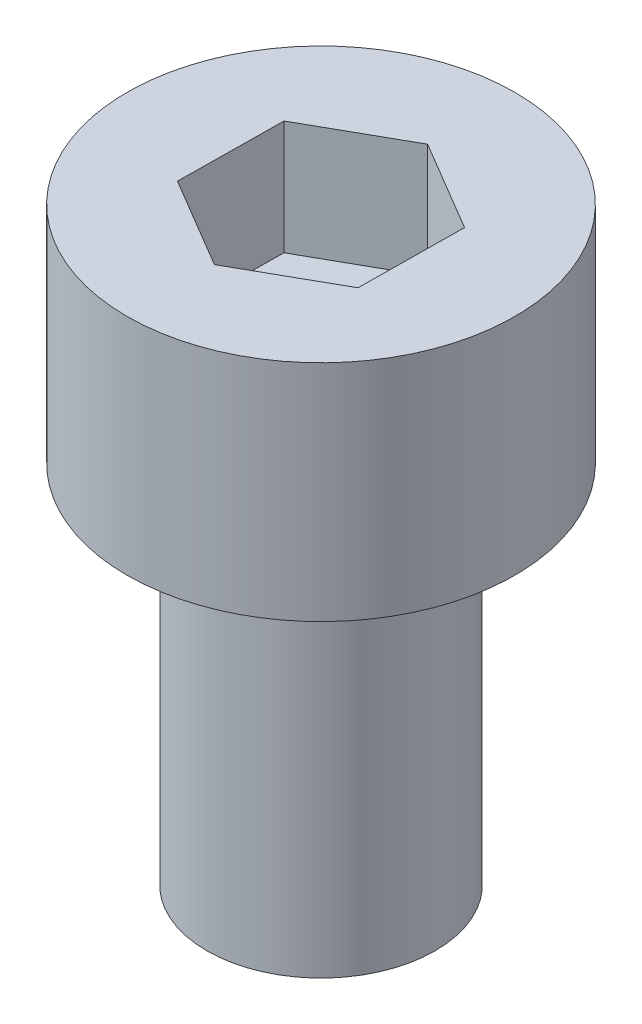
ISO-10303-21;
HEADER;
FILE_DESCRIPTION(('STEP AP214'),'2;1');
FILE_NAME('part.step','',(''),(''),'','','');
FILE_SCHEMA(('AUTOMOTIVE_DESIGN { 1 0 10303 214 1 1 1 1 }'));
ENDSEC;
DATA;
#1=APPLICATION_CONTEXT('core data for automotive mechanical design processes');
#2=APPLICATION_PROTOCOL_DEFINITION('international standard','automotive_design',2000,#1);
#3=PRODUCT_CONTEXT('',#1,'mechanical');
#4=PRODUCT('Part','Part','',(#3));
#5=PRODUCT_RELATED_PRODUCT_CATEGORY('part','',(#4));
#6=PRODUCT_DEFINITION_FORMATION('','',#4);
#7=PRODUCT_DEFINITION_CONTEXT('part definition',#1,'design');
#8=PRODUCT_DEFINITION('design','',#6,#7);
#9=PRODUCT_DEFINITION_SHAPE('','',#8);
#10=(LENGTH_UNIT() NAMED_UNIT(*) SI_UNIT(.MILLI.,.METRE.));
#11=(NAMED_UNIT(*) PLANE_ANGLE_UNIT() SI_UNIT($,.RADIAN.));
#12=(NAMED_UNIT(*) SI_UNIT($,.STERADIAN.) SOLID_ANGLE_UNIT());
#13=UNCERTAINTY_MEASURE_WITH_UNIT(LENGTH_MEASURE(1.E-05),#10,'distance_accuracy_value','');
#14=(GEOMETRIC_REPRESENTATION_CONTEXT(3) GLOBAL_UNCERTAINTY_ASSIGNED_CONTEXT((#13)) GLOBAL_UNIT_ASSIGNED_CONTEXT((#10,
#11,#12)) REPRESENTATION_CONTEXT('',''));
#15=CARTESIAN_POINT('',(0.,0.,0.));
#16=DIRECTION('',(0.,0.,1.));
#17=DIRECTION('',(1.,0.,0.));
#18=AXIS2_PLACEMENT_3D('',#15,#16,#17);
#19=CARTESIAN_POINT('',(0.,8.,0.));
#20=DIRECTION('',(0.,-1.,0.));
#21=DIRECTION('',(0.,0.,-1.));
#22=AXIS2_PLACEMENT_3D('',#19,#20,#21);
#23=CYLINDRICAL_SURFACE('',#22,2.5);
#24=CARTESIAN_POINT('',(0.,8.,0.));
#25=DIRECTION('',(0.,1.,0.));
#26=DIRECTION('',(0.,0.,1.));
#27=AXIS2_PLACEMENT_3D('',#24,#25,#26);
#28=CIRCLE('',#27,2.5);
#29=CARTESIAN_POINT('',(0.,8.,2.5));
#30=VERTEX_POINT('',#29);
#31=EDGE_CURVE('E11',#30,#30,#28,.T.);
#32=ORIENTED_EDGE('',*,*,#31,.F.);
#33=EDGE_LOOP('',(#32));
#34=FACE_BOUND('',#33,.T.);
#35=CARTESIAN_POINT('',(0.,0.,0.));
#36=DIRECTION('',(0.,1.,0.));
#37=DIRECTION('',(0.,0.,1.));
#38=AXIS2_PLACEMENT_3D('',#35,#36,#37);
#39=CIRCLE('',#38,2.5);
#40=CARTESIAN_POINT('',(0.,0.,2.5));
#41=VERTEX_POINT('',#40);
#42=EDGE_CURVE('E42',#41,#41,#39,.T.);
#43=ORIENTED_EDGE('',*,*,#42,.T.);
#44=EDGE_LOOP('',(#43));
#45=FACE_BOUND('',#44,.T.);
#46=ADVANCED_FACE('F39',(#34,#45),#23,.T.);
#47=CARTESIAN_POINT('',(0.,0.,0.));
#48=DIRECTION('',(0.,1.,0.));
#49=DIRECTION('',(0.,0.,1.));
#50=AXIS2_PLACEMENT_3D('',#47,#48,#49);
#51=PLANE('',#50);
#52=ORIENTED_EDGE('',*,*,#42,.F.);
#53=EDGE_LOOP('',(#52));
#54=FACE_BOUND('',#53,.T.);
#55=ADVANCED_FACE('F189',(#54),#51,.F.);
#56=CARTESIAN_POINT('',(0.,12.91,0.));
#57=DIRECTION('',(0.,-1.,0.));
#58=DIRECTION('',(0.,0.,-1.));
#59=AXIS2_PLACEMENT_3D('',#56,#57,#58);
#60=CYLINDRICAL_SURFACE('',#59,4.25);
#61=CARTESIAN_POINT('',(0.,12.91,0.));
#62=DIRECTION('',(0.,1.,0.));
#63=DIRECTION('',(0.,0.,1.));
#64=AXIS2_PLACEMENT_3D('',#61,#62,#63);
#65=CIRCLE('',#64,4.25);
#66=CARTESIAN_POINT('',(0.,12.91,4.25));
#67=VERTEX_POINT('',#66);
#68=EDGE_CURVE('E163',#67,#67,#65,.T.);
#69=ORIENTED_EDGE('',*,*,#68,.F.);
#70=EDGE_LOOP('',(#69));
#71=FACE_BOUND('',#70,.T.);
#72=CARTESIAN_POINT('',(0.,8.,0.));
#73=DIRECTION('',(0.,1.,0.));
#74=DIRECTION('',(0.,0.,1.));
#75=AXIS2_PLACEMENT_3D('',#72,#73,#74);
#76=CIRCLE('',#75,4.25);
#77=CARTESIAN_POINT('',(0.,8.,4.25));
#78=VERTEX_POINT('',#77);
#79=EDGE_CURVE('E153',#78,#78,#76,.T.);
#80=ORIENTED_EDGE('',*,*,#79,.T.);
#81=EDGE_LOOP('',(#80));
#82=FACE_BOUND('',#81,.T.);
#83=ADVANCED_FACE('F171',(#71,#82),#60,.T.);
#84=CARTESIAN_POINT('',(0.,12.91,0.));
#85=DIRECTION('',(0.,1.,0.));
#86=DIRECTION('',(0.,0.,1.));
#87=AXIS2_PLACEMENT_3D('',#84,#85,#86);
#88=PLANE('',#87);
#89=DIRECTION('',(0.871446941935933,0.,-0.490489783166286));
#90=VECTOR('',#89,1.);
#91=CARTESIAN_POINT('',(-0.0252806866898007,12.91,2.3092627005635));
#92=LINE('',#91,#90);
#93=CARTESIAN_POINT('',(-0.0252806866898007,12.91,2.3092627005635));
#94=VERTEX_POINT('',#93);
#95=CARTESIAN_POINT('',(1.98723981935495,12.91,1.17652506718023));
#96=VERTEX_POINT('',#95);
#97=EDGE_CURVE('E54',#94,#96,#92,.T.);
#98=ORIENTED_EDGE('',*,*,#97,.F.);
#99=DIRECTION('',(0.860500083486691,0.,0.509450298183638));
#100=VECTOR('',#99,1.);
#101=CARTESIAN_POINT('',(-2.01252050604475,12.91,1.13273763338327));
#102=LINE('',#101,#100);
#103=CARTESIAN_POINT('',(-2.01252050604475,12.91,1.13273763338327));
#104=VERTEX_POINT('',#103);
#105=EDGE_CURVE('E147',#104,#94,#102,.T.);
#106=ORIENTED_EDGE('',*,*,#105,.F.);
#107=DIRECTION('',(-0.0109468584492415,0.,0.999940081349924));
#108=VECTOR('',#107,1.);
#109=CARTESIAN_POINT('',(-1.98723981935495,12.91,-1.17652506718023));
#110=LINE('',#109,#108);
#111=CARTESIAN_POINT('',(-1.98723981935495,12.91,-1.17652506718023));
#112=VERTEX_POINT('',#111);
#113=EDGE_CURVE('E144',#112,#104,#110,.T.);
#114=ORIENTED_EDGE('',*,*,#113,.F.);
#115=DIRECTION('',(-0.871446941935933,0.,0.490489783166286));
#116=VECTOR('',#115,1.);
#117=CARTESIAN_POINT('',(0.0252806866898017,12.91,-2.3092627005635));
#118=LINE('',#117,#116);
#119=CARTESIAN_POINT('',(0.0252806866898017,12.91,-2.3092627005635));
#120=VERTEX_POINT('',#119);
#121=EDGE_CURVE('E102',#120,#112,#118,.T.);
#122=ORIENTED_EDGE('',*,*,#121,.F.);
#123=DIRECTION('',(-0.860500083486691,0.,-0.509450298183638));
#124=VECTOR('',#123,1.);
#125=CARTESIAN_POINT('',(2.01252050604475,12.91,-1.13273763338327));
#126=LINE('',#125,#124);
#127=CARTESIAN_POINT('',(2.01252050604475,12.91,-1.13273763338327));
#128=VERTEX_POINT('',#127);
#129=EDGE_CURVE('E138',#128,#120,#126,.T.);
#130=ORIENTED_EDGE('',*,*,#129,.F.);
#131=DIRECTION('',(0.0109468584492411,0.,-0.999940081349924));
#132=VECTOR('',#131,1.);
#133=CARTESIAN_POINT('',(1.98723981935495,12.91,1.17652506718023));
#134=LINE('',#133,#132);
#135=EDGE_CURVE('E134',#96,#128,#134,.T.);
#136=ORIENTED_EDGE('',*,*,#135,.F.);
#137=EDGE_LOOP('',(#98,#106,#114,#122,#130,#136));
#138=FACE_BOUND('',#137,.T.);
#139=ORIENTED_EDGE('',*,*,#68,.T.);
#140=EDGE_LOOP('',(#139));
#141=FACE_BOUND('',#140,.T.);
#142=ADVANCED_FACE('F176',(#138,#141),#88,.T.);
#143=CARTESIAN_POINT('',(0.,8.,0.));
#144=DIRECTION('',(0.,1.,0.));
#145=DIRECTION('',(0.,0.,1.));
#146=AXIS2_PLACEMENT_3D('',#143,#144,#145);
#147=PLANE('',#146);
#148=ORIENTED_EDGE('',*,*,#31,.T.);
#149=EDGE_LOOP('',(#148));
#150=FACE_BOUND('',#149,.T.);
#151=ORIENTED_EDGE('',*,*,#79,.F.);
#152=EDGE_LOOP('',(#151));
#153=FACE_BOUND('',#152,.T.);
#154=ADVANCED_FACE('F173',(#150,#153),#147,.F.);
#155=CARTESIAN_POINT('',(-0.0252806866898007,10.41,2.3092627005635));
#156=DIRECTION('',(0.490489783166286,0.,0.871446941935933));
#157=DIRECTION('',(0.871446941935933,0.,-0.490489783166286));
#158=AXIS2_PLACEMENT_3D('',#155,#156,#157);
#159=PLANE('',#158);
#160=ORIENTED_EDGE('',*,*,#97,.T.);
#161=DIRECTION('',(0.,1.,0.));
#162=VECTOR('',#161,1.);
#163=CARTESIAN_POINT('',(1.98723981935495,10.41,1.17652506718023));
#164=LINE('',#163,#162);
#165=CARTESIAN_POINT('',(1.98723981935495,10.41,1.17652506718023));
#166=VERTEX_POINT('',#165);
#167=EDGE_CURVE('E84',#166,#96,#164,.T.);
#168=ORIENTED_EDGE('',*,*,#167,.F.);
#169=DIRECTION('',(0.871446941935933,0.,-0.490489783166286));
#170=VECTOR('',#169,1.);
#171=CARTESIAN_POINT('',(-0.0252806866898007,10.41,2.3092627005635));
#172=LINE('',#171,#170);
#173=CARTESIAN_POINT('',(-0.0252806866898007,10.41,2.3092627005635));
#174=VERTEX_POINT('',#173);
#175=EDGE_CURVE('E150',#174,#166,#172,.T.);
#176=ORIENTED_EDGE('',*,*,#175,.F.);
#177=DIRECTION('',(0.,1.,0.));
#178=VECTOR('',#177,1.);
#179=CARTESIAN_POINT('',(-0.0252806866898007,10.41,2.3092627005635));
#180=LINE('',#179,#178);
#181=EDGE_CURVE('E62',#174,#94,#180,.T.);
#182=ORIENTED_EDGE('',*,*,#181,.T.);
#183=EDGE_LOOP('',(#160,#168,#176,#182));
#184=FACE_BOUND('',#183,.T.);
#185=ADVANCED_FACE('F175',(#184),#159,.F.);
#186=CARTESIAN_POINT('',(-2.01252050604475,10.41,1.13273763338327));
#187=DIRECTION('',(-0.509450298183638,0.,0.860500083486691));
#188=DIRECTION('',(0.860500083486691,0.,0.509450298183638));
#189=AXIS2_PLACEMENT_3D('',#186,#187,#188);
#190=PLANE('',#189);
#191=ORIENTED_EDGE('',*,*,#105,.T.);
#192=ORIENTED_EDGE('',*,*,#181,.F.);
#193=DIRECTION('',(0.860500083486691,0.,0.509450298183638));
#194=VECTOR('',#193,1.);
#195=CARTESIAN_POINT('',(-2.01252050604475,10.41,1.13273763338327));
#196=LINE('',#195,#194);
#197=CARTESIAN_POINT('',(-2.01252050604475,10.41,1.13273763338327));
#198=VERTEX_POINT('',#197);
#199=EDGE_CURVE('E116',#198,#174,#196,.T.);
#200=ORIENTED_EDGE('',*,*,#199,.F.);
#201=DIRECTION('',(0.,1.,0.));
#202=VECTOR('',#201,1.);
#203=CARTESIAN_POINT('',(-2.01252050604475,10.41,1.13273763338327));
#204=LINE('',#203,#202);
#205=EDGE_CURVE('E107',#198,#104,#204,.T.);
#206=ORIENTED_EDGE('',*,*,#205,.T.);
#207=EDGE_LOOP('',(#191,#192,#200,#206));
#208=FACE_BOUND('',#207,.T.);
#209=ADVANCED_FACE('F183',(#208),#190,.F.);
#210=CARTESIAN_POINT('',(-1.98723981935495,10.41,-1.17652506718023));
#211=DIRECTION('',(-0.999940081349924,0.,-0.0109468584492415));
#212=DIRECTION('',(-0.0109468584492415,0.,0.999940081349924));
#213=AXIS2_PLACEMENT_3D('',#210,#211,#212);
#214=PLANE('',#213);
#215=ORIENTED_EDGE('',*,*,#113,.T.);
#216=ORIENTED_EDGE('',*,*,#205,.F.);
#217=DIRECTION('',(-0.0109468584492415,0.,0.999940081349924));
#218=VECTOR('',#217,1.);
#219=CARTESIAN_POINT('',(-1.98723981935495,10.41,-1.17652506718023));
#220=LINE('',#219,#218);
#221=CARTESIAN_POINT('',(-1.98723981935495,10.41,-1.17652506718023));
#222=VERTEX_POINT('',#221);
#223=EDGE_CURVE('E111',#222,#198,#220,.T.);
#224=ORIENTED_EDGE('',*,*,#223,.F.);
#225=DIRECTION('',(0.,1.,0.));
#226=VECTOR('',#225,1.);
#227=CARTESIAN_POINT('',(-1.98723981935495,10.41,-1.17652506718023));
#228=LINE('',#227,#226);
#229=EDGE_CURVE('E95',#222,#112,#228,.T.);
#230=ORIENTED_EDGE('',*,*,#229,.T.);
#231=EDGE_LOOP('',(#215,#216,#224,#230));
#232=FACE_BOUND('',#231,.T.);
#233=ADVANCED_FACE('F112',(#232),#214,.F.);
#234=CARTESIAN_POINT('',(0.0252806866898017,10.41,-2.3092627005635));
#235=DIRECTION('',(-0.490489783166286,0.,-0.871446941935933));
#236=DIRECTION('',(-0.871446941935933,0.,0.490489783166286));
#237=AXIS2_PLACEMENT_3D('',#234,#235,#236);
#238=PLANE('',#237);
#239=ORIENTED_EDGE('',*,*,#121,.T.);
#240=ORIENTED_EDGE('',*,*,#229,.F.);
#241=DIRECTION('',(-0.871446941935933,0.,0.490489783166286));
#242=VECTOR('',#241,1.);
#243=CARTESIAN_POINT('',(0.0252806866898017,10.41,-2.3092627005635));
#244=LINE('',#243,#242);
#245=CARTESIAN_POINT('',(0.0252806866898017,10.41,-2.3092627005635));
#246=VERTEX_POINT('',#245);
#247=EDGE_CURVE('E99',#246,#222,#244,.T.);
#248=ORIENTED_EDGE('',*,*,#247,.F.);
#249=DIRECTION('',(0.,1.,0.));
#250=VECTOR('',#249,1.);
#251=CARTESIAN_POINT('',(0.0252806866898017,10.41,-2.3092627005635));
#252=LINE('',#251,#250);
#253=EDGE_CURVE('E108',#246,#120,#252,.T.);
#254=ORIENTED_EDGE('',*,*,#253,.T.);
#255=EDGE_LOOP('',(#239,#240,#248,#254));
#256=FACE_BOUND('',#255,.T.);
#257=ADVANCED_FACE('F97',(#256),#238,.F.);
#258=CARTESIAN_POINT('',(2.01252050604475,10.41,-1.13273763338327));
#259=DIRECTION('',(0.509450298183638,0.,-0.860500083486691));
#260=DIRECTION('',(-0.860500083486691,0.,-0.509450298183638));
#261=AXIS2_PLACEMENT_3D('',#258,#259,#260);
#262=PLANE('',#261);
#263=ORIENTED_EDGE('',*,*,#129,.T.);
#264=ORIENTED_EDGE('',*,*,#253,.F.);
#265=DIRECTION('',(-0.860500083486691,0.,-0.509450298183638));
#266=VECTOR('',#265,1.);
#267=CARTESIAN_POINT('',(2.01252050604475,10.41,-1.13273763338327));
#268=LINE('',#267,#266);
#269=CARTESIAN_POINT('',(2.01252050604475,10.41,-1.13273763338327));
#270=VERTEX_POINT('',#269);
#271=EDGE_CURVE('E122',#270,#246,#268,.T.);
#272=ORIENTED_EDGE('',*,*,#271,.F.);
#273=DIRECTION('',(0.,1.,0.));
#274=VECTOR('',#273,1.);
#275=CARTESIAN_POINT('',(2.01252050604475,10.41,-1.13273763338327));
#276=LINE('',#275,#274);
#277=EDGE_CURVE('E158',#270,#128,#276,.T.);
#278=ORIENTED_EDGE('',*,*,#277,.T.);
#279=EDGE_LOOP('',(#263,#264,#272,#278));
#280=FACE_BOUND('',#279,.T.);
#281=ADVANCED_FACE('F245',(#280),#262,.F.);
#282=CARTESIAN_POINT('',(1.98723981935495,10.41,1.17652506718023));
#283=DIRECTION('',(0.999940081349924,0.,0.0109468584492411));
#284=DIRECTION('',(0.0109468584492411,0.,-0.999940081349924));
#285=AXIS2_PLACEMENT_3D('',#282,#283,#284);
#286=PLANE('',#285);
#287=ORIENTED_EDGE('',*,*,#135,.T.);
#288=ORIENTED_EDGE('',*,*,#277,.F.);
#289=DIRECTION('',(0.0109468584492411,0.,-0.999940081349924));
#290=VECTOR('',#289,1.);
#291=CARTESIAN_POINT('',(1.98723981935495,10.41,1.17652506718023));
#292=LINE('',#291,#290);
#293=EDGE_CURVE('E126',#166,#270,#292,.T.);
#294=ORIENTED_EDGE('',*,*,#293,.F.);
#295=ORIENTED_EDGE('',*,*,#167,.T.);
#296=EDGE_LOOP('',(#287,#288,#294,#295));
#297=FACE_BOUND('',#296,.T.);
#298=ADVANCED_FACE('F254',(#297),#286,.F.);
#299=CARTESIAN_POINT('',(0.,10.41,0.));
#300=DIRECTION('',(0.,1.,0.));
#301=DIRECTION('',(0.,0.,1.));
#302=AXIS2_PLACEMENT_3D('',#299,#300,#301);
#303=PLANE('',#302);
#304=ORIENTED_EDGE('',*,*,#175,.T.);
#305=ORIENTED_EDGE('',*,*,#293,.T.);
#306=ORIENTED_EDGE('',*,*,#271,.T.);
#307=ORIENTED_EDGE('',*,*,#247,.T.);
#308=ORIENTED_EDGE('',*,*,#223,.T.);
#309=ORIENTED_EDGE('',*,*,#199,.T.);
#310=EDGE_LOOP('',(#304,#305,#306,#307,#308,#309));
#311=FACE_BOUND('',#310,.T.);
#312=ADVANCED_FACE('F119',(#311),#303,.T.);
#313=CLOSED_SHELL('',(#46,#55,#83,#142,#154,#185,#209,#233,#257,#281,#298,#312));
#314=MANIFOLD_SOLID_BREP('B2',#313);
#315=ADVANCED_BREP_SHAPE_REPRESENTATION('',(#18,#314),#14);
#316=SHAPE_DEFINITION_REPRESENTATION(#9,#315);
ENDSEC;
END-ISO-10303-21;
